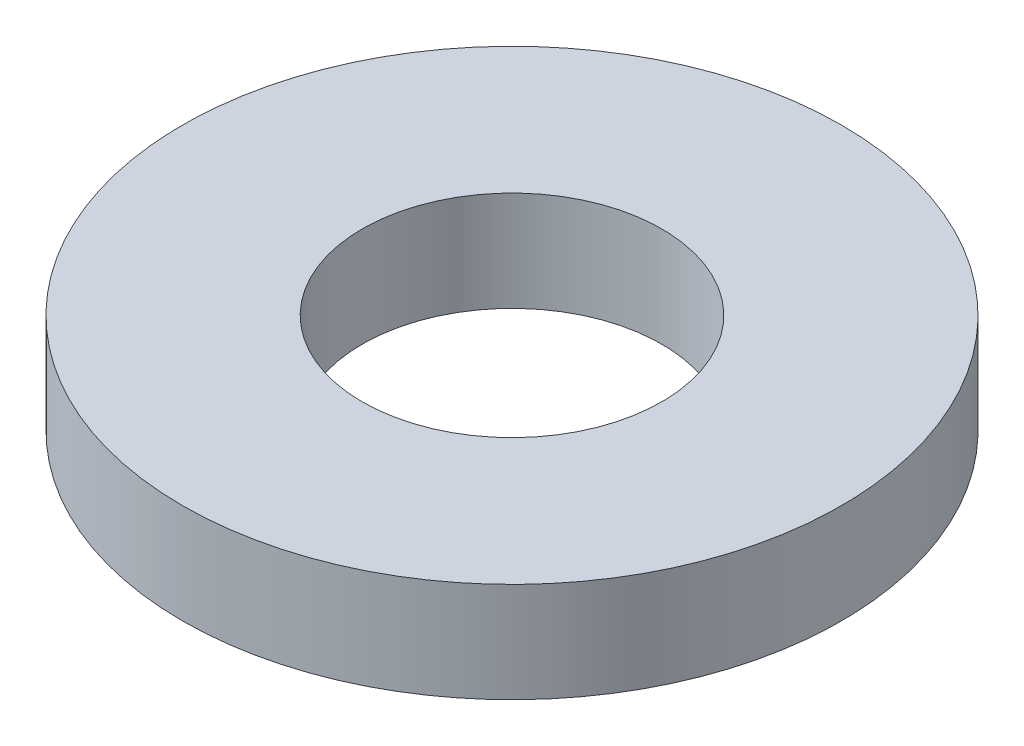
ISO-10303-21;
HEADER;
FILE_DESCRIPTION(('STEP AP214'),'2;1');
FILE_NAME('part.step','',(''),(''),'','','');
FILE_SCHEMA(('AUTOMOTIVE_DESIGN { 1 0 10303 214 1 1 1 1 }'));
ENDSEC;
DATA;
#1=APPLICATION_CONTEXT('core data for automotive mechanical design processes');
#2=APPLICATION_PROTOCOL_DEFINITION('international standard','automotive_design',2000,#1);
#3=PRODUCT_CONTEXT('',#1,'mechanical');
#4=PRODUCT('Part','Part','',(#3));
#5=PRODUCT_RELATED_PRODUCT_CATEGORY('part','',(#4));
#6=PRODUCT_DEFINITION_FORMATION('','',#4);
#7=PRODUCT_DEFINITION_CONTEXT('part definition',#1,'design');
#8=PRODUCT_DEFINITION('design','',#6,#7);
#9=PRODUCT_DEFINITION_SHAPE('','',#8);
#10=(LENGTH_UNIT() NAMED_UNIT(*) SI_UNIT(.MILLI.,.METRE.));
#11=(NAMED_UNIT(*) PLANE_ANGLE_UNIT() SI_UNIT($,.RADIAN.));
#12=(NAMED_UNIT(*) SI_UNIT($,.STERADIAN.) SOLID_ANGLE_UNIT());
#13=UNCERTAINTY_MEASURE_WITH_UNIT(LENGTH_MEASURE(1.E-05),#10,'distance_accuracy_value','');
#14=(GEOMETRIC_REPRESENTATION_CONTEXT(3) GLOBAL_UNCERTAINTY_ASSIGNED_CONTEXT((#13)) GLOBAL_UNIT_ASSIGNED_CONTEXT((#10,
#11,#12)) REPRESENTATION_CONTEXT('',''));
#15=CARTESIAN_POINT('',(0.,0.,0.));
#16=DIRECTION('',(0.,0.,1.));
#17=DIRECTION('',(1.,0.,0.));
#18=AXIS2_PLACEMENT_3D('',#15,#16,#17);
#19=CARTESIAN_POINT('',(0.,25.,0.));
#20=DIRECTION('',(0.,-1.,0.));
#21=DIRECTION('',(0.,0.,-1.));
#22=AXIS2_PLACEMENT_3D('',#19,#20,#21);
#23=CYLINDRICAL_SURFACE('',#22,82.5);
#24=CARTESIAN_POINT('',(0.,25.,0.));
#25=DIRECTION('',(0.,1.,0.));
#26=DIRECTION('',(0.,0.,1.));
#27=AXIS2_PLACEMENT_3D('',#24,#25,#26);
#28=CIRCLE('',#27,82.5);
#29=CARTESIAN_POINT('',(0.,25.,82.5));
#30=VERTEX_POINT('',#29);
#31=EDGE_CURVE('E10',#30,#30,#28,.T.);
#32=ORIENTED_EDGE('',*,*,#31,.F.);
#33=EDGE_LOOP('',(#32));
#34=FACE_BOUND('',#33,.T.);
#35=CARTESIAN_POINT('',(0.,0.,0.));
#36=DIRECTION('',(0.,1.,0.));
#37=DIRECTION('',(0.,0.,1.));
#38=AXIS2_PLACEMENT_3D('',#35,#36,#37);
#39=CIRCLE('',#38,82.5);
#40=CARTESIAN_POINT('',(0.,0.,82.5));
#41=VERTEX_POINT('',#40);
#42=EDGE_CURVE('E37',#41,#41,#39,.T.);
#43=ORIENTED_EDGE('',*,*,#42,.T.);
#44=EDGE_LOOP('',(#43));
#45=FACE_BOUND('',#44,.T.);
#46=ADVANCED_FACE('F40',(#34,#45),#23,.T.);
#47=CARTESIAN_POINT('',(0.,25.,0.));
#48=DIRECTION('',(0.,1.,0.));
#49=DIRECTION('',(0.,0.,1.));
#50=AXIS2_PLACEMENT_3D('',#47,#48,#49);
#51=PLANE('',#50);
#52=CARTESIAN_POINT('',(0.,25.,0.));
#53=DIRECTION('',(0.,1.,0.));
#54=DIRECTION('',(0.,0.,1.));
#55=AXIS2_PLACEMENT_3D('',#52,#53,#54);
#56=CIRCLE('',#55,37.5);
#57=CARTESIAN_POINT('',(0.,25.,37.5));
#58=VERTEX_POINT('',#57);
#59=EDGE_CURVE('E50',#58,#58,#56,.T.);
#60=ORIENTED_EDGE('',*,*,#59,.F.);
#61=EDGE_LOOP('',(#60));
#62=FACE_BOUND('',#61,.T.);
#63=ORIENTED_EDGE('',*,*,#31,.T.);
#64=EDGE_LOOP('',(#63));
#65=FACE_BOUND('',#64,.T.);
#66=ADVANCED_FACE('F59',(#62,#65),#51,.T.);
#67=CARTESIAN_POINT('',(0.,0.,0.));
#68=DIRECTION('',(0.,1.,0.));
#69=DIRECTION('',(0.,0.,1.));
#70=AXIS2_PLACEMENT_3D('',#67,#68,#69);
#71=PLANE('',#70);
#72=CARTESIAN_POINT('',(0.,0.,0.));
#73=DIRECTION('',(0.,1.,0.));
#74=DIRECTION('',(0.,0.,1.));
#75=AXIS2_PLACEMENT_3D('',#72,#73,#74);
#76=CIRCLE('',#75,37.5);
#77=CARTESIAN_POINT('',(0.,0.,37.5));
#78=VERTEX_POINT('',#77);
#79=EDGE_CURVE('E47',#78,#78,#76,.T.);
#80=ORIENTED_EDGE('',*,*,#79,.T.);
#81=EDGE_LOOP('',(#80));
#82=FACE_BOUND('',#81,.T.);
#83=ORIENTED_EDGE('',*,*,#42,.F.);
#84=EDGE_LOOP('',(#83));
#85=FACE_BOUND('',#84,.T.);
#86=ADVANCED_FACE('F58',(#82,#85),#71,.F.);
#87=CARTESIAN_POINT('',(0.,25.,0.));
#88=DIRECTION('',(0.,-1.,0.));
#89=DIRECTION('',(0.,0.,-1.));
#90=AXIS2_PLACEMENT_3D('',#87,#88,#89);
#91=CYLINDRICAL_SURFACE('',#90,37.5);
#92=ORIENTED_EDGE('',*,*,#59,.T.);
#93=EDGE_LOOP('',(#92));
#94=FACE_BOUND('',#93,.T.);
#95=ORIENTED_EDGE('',*,*,#79,.F.);
#96=EDGE_LOOP('',(#95));
#97=FACE_BOUND('',#96,.T.);
#98=ADVANCED_FACE('F54',(#94,#97),#91,.F.);
#99=CLOSED_SHELL('',(#46,#66,#86,#98));
#100=MANIFOLD_SOLID_BREP('B2',#99);
#101=ADVANCED_BREP_SHAPE_REPRESENTATION('',(#18,#100),#14);
#102=SHAPE_DEFINITION_REPRESENTATION(#9,#101);
ENDSEC;
END-ISO-10303-21;
